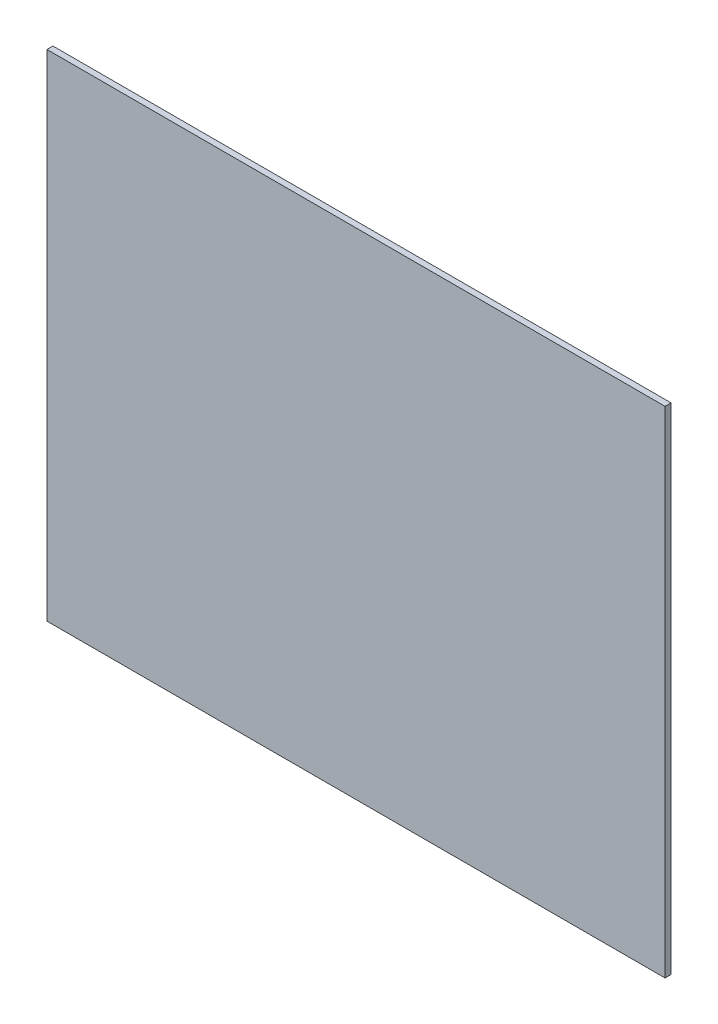
ISO-10303-21;
HEADER;
FILE_DESCRIPTION(('STEP AP214'),'2;1');
FILE_NAME('part.step','',(''),(''),'','','');
FILE_SCHEMA(('AUTOMOTIVE_DESIGN { 1 0 10303 214 1 1 1 1 }'));
ENDSEC;
DATA;
#1=APPLICATION_CONTEXT('core data for automotive mechanical design processes');
#2=APPLICATION_PROTOCOL_DEFINITION('international standard','automotive_design',2000,#1);
#3=PRODUCT_CONTEXT('',#1,'mechanical');
#4=PRODUCT('Part','Part','',(#3));
#5=PRODUCT_RELATED_PRODUCT_CATEGORY('part','',(#4));
#6=PRODUCT_DEFINITION_FORMATION('','',#4);
#7=PRODUCT_DEFINITION_CONTEXT('part definition',#1,'design');
#8=PRODUCT_DEFINITION('design','',#6,#7);
#9=PRODUCT_DEFINITION_SHAPE('','',#8);
#10=(LENGTH_UNIT() NAMED_UNIT(*) SI_UNIT(.MILLI.,.METRE.));
#11=(NAMED_UNIT(*) PLANE_ANGLE_UNIT() SI_UNIT($,.RADIAN.));
#12=(NAMED_UNIT(*) SI_UNIT($,.STERADIAN.) SOLID_ANGLE_UNIT());
#13=UNCERTAINTY_MEASURE_WITH_UNIT(LENGTH_MEASURE(1.E-05),#10,'distance_accuracy_value','');
#14=(GEOMETRIC_REPRESENTATION_CONTEXT(3) GLOBAL_UNCERTAINTY_ASSIGNED_CONTEXT((#13)) GLOBAL_UNIT_ASSIGNED_CONTEXT((#10,
#11,#12)) REPRESENTATION_CONTEXT('',''));
#15=CARTESIAN_POINT('',(0.,0.,0.));
#16=DIRECTION('',(0.,0.,1.));
#17=DIRECTION('',(1.,0.,0.));
#18=AXIS2_PLACEMENT_3D('',#15,#16,#17);
#19=CARTESIAN_POINT('',(0.,0.,4.));
#20=DIRECTION('',(1.,0.,0.));
#21=DIRECTION('',(0.,0.,-1.));
#22=AXIS2_PLACEMENT_3D('',#19,#20,#21);
#23=PLANE('',#22);
#24=DIRECTION('',(0.,-1.,0.));
#25=VECTOR('',#24,1.);
#26=CARTESIAN_POINT('',(0.,0.,0.));
#27=LINE('',#26,#25);
#28=CARTESIAN_POINT('',(0.,330.,0.));
#29=VERTEX_POINT('',#28);
#30=CARTESIAN_POINT('',(0.,0.,0.));
#31=VERTEX_POINT('',#30);
#32=EDGE_CURVE('E95',#29,#31,#27,.T.);
#33=ORIENTED_EDGE('',*,*,#32,.T.);
#34=DIRECTION('',(0.,0.,-1.));
#35=VECTOR('',#34,1.);
#36=CARTESIAN_POINT('',(0.,0.,4.));
#37=LINE('',#36,#35);
#38=CARTESIAN_POINT('',(0.,0.,4.));
#39=VERTEX_POINT('',#38);
#40=EDGE_CURVE('E11',#39,#31,#37,.T.);
#41=ORIENTED_EDGE('',*,*,#40,.F.);
#42=DIRECTION('',(0.,-1.,0.));
#43=VECTOR('',#42,1.);
#44=CARTESIAN_POINT('',(0.,0.,4.));
#45=LINE('',#44,#43);
#46=CARTESIAN_POINT('',(0.,330.,4.));
#47=VERTEX_POINT('',#46);
#48=EDGE_CURVE('E83',#47,#39,#45,.T.);
#49=ORIENTED_EDGE('',*,*,#48,.F.);
#50=DIRECTION('',(0.,0.,-1.));
#51=VECTOR('',#50,1.);
#52=CARTESIAN_POINT('',(0.,330.,4.));
#53=LINE('',#52,#51);
#54=EDGE_CURVE('E91',#47,#29,#53,.T.);
#55=ORIENTED_EDGE('',*,*,#54,.T.);
#56=EDGE_LOOP('',(#33,#41,#49,#55));
#57=FACE_BOUND('',#56,.T.);
#58=ADVANCED_FACE('F32',(#57),#23,.F.);
#59=CARTESIAN_POINT('',(0.,0.,4.));
#60=DIRECTION('',(0.,1.,0.));
#61=DIRECTION('',(0.,0.,1.));
#62=AXIS2_PLACEMENT_3D('',#59,#60,#61);
#63=PLANE('',#62);
#64=DIRECTION('',(1.,0.,0.));
#65=VECTOR('',#64,1.);
#66=CARTESIAN_POINT('',(0.,0.,0.));
#67=LINE('',#66,#65);
#68=CARTESIAN_POINT('',(412.,0.,0.));
#69=VERTEX_POINT('',#68);
#70=EDGE_CURVE('E87',#31,#69,#67,.T.);
#71=ORIENTED_EDGE('',*,*,#70,.T.);
#72=DIRECTION('',(0.,0.,-1.));
#73=VECTOR('',#72,1.);
#74=CARTESIAN_POINT('',(412.,0.,4.));
#75=LINE('',#74,#73);
#76=CARTESIAN_POINT('',(412.,0.,4.));
#77=VERTEX_POINT('',#76);
#78=EDGE_CURVE('E40',#77,#69,#75,.T.);
#79=ORIENTED_EDGE('',*,*,#78,.F.);
#80=DIRECTION('',(1.,0.,0.));
#81=VECTOR('',#80,1.);
#82=CARTESIAN_POINT('',(0.,0.,4.));
#83=LINE('',#82,#81);
#84=EDGE_CURVE('E78',#39,#77,#83,.T.);
#85=ORIENTED_EDGE('',*,*,#84,.F.);
#86=ORIENTED_EDGE('',*,*,#40,.T.);
#87=EDGE_LOOP('',(#71,#79,#85,#86));
#88=FACE_BOUND('',#87,.T.);
#89=ADVANCED_FACE('F86',(#88),#63,.F.);
#90=CARTESIAN_POINT('',(412.,0.,4.));
#91=DIRECTION('',(-1.,0.,0.));
#92=DIRECTION('',(0.,0.,1.));
#93=AXIS2_PLACEMENT_3D('',#90,#91,#92);
#94=PLANE('',#93);
#95=DIRECTION('',(0.,1.,0.));
#96=VECTOR('',#95,1.);
#97=CARTESIAN_POINT('',(412.,0.,0.));
#98=LINE('',#97,#96);
#99=CARTESIAN_POINT('',(412.,330.,0.));
#100=VERTEX_POINT('',#99);
#101=EDGE_CURVE('E65',#69,#100,#98,.T.);
#102=ORIENTED_EDGE('',*,*,#101,.T.);
#103=DIRECTION('',(0.,0.,-1.));
#104=VECTOR('',#103,1.);
#105=CARTESIAN_POINT('',(412.,330.,4.));
#106=LINE('',#105,#104);
#107=CARTESIAN_POINT('',(412.,330.,4.));
#108=VERTEX_POINT('',#107);
#109=EDGE_CURVE('E88',#108,#100,#106,.T.);
#110=ORIENTED_EDGE('',*,*,#109,.F.);
#111=DIRECTION('',(0.,1.,0.));
#112=VECTOR('',#111,1.);
#113=CARTESIAN_POINT('',(412.,0.,4.));
#114=LINE('',#113,#112);
#115=EDGE_CURVE('E81',#77,#108,#114,.T.);
#116=ORIENTED_EDGE('',*,*,#115,.F.);
#117=ORIENTED_EDGE('',*,*,#78,.T.);
#118=EDGE_LOOP('',(#102,#110,#116,#117));
#119=FACE_BOUND('',#118,.T.);
#120=ADVANCED_FACE('F89',(#119),#94,.F.);
#121=CARTESIAN_POINT('',(0.,330.,4.));
#122=DIRECTION('',(0.,-1.,0.));
#123=DIRECTION('',(0.,0.,-1.));
#124=AXIS2_PLACEMENT_3D('',#121,#122,#123);
#125=PLANE('',#124);
#126=DIRECTION('',(-1.,0.,0.));
#127=VECTOR('',#126,1.);
#128=CARTESIAN_POINT('',(0.,330.,0.));
#129=LINE('',#128,#127);
#130=EDGE_CURVE('E71',#100,#29,#129,.T.);
#131=ORIENTED_EDGE('',*,*,#130,.T.);
#132=ORIENTED_EDGE('',*,*,#54,.F.);
#133=DIRECTION('',(-1.,0.,0.));
#134=VECTOR('',#133,1.);
#135=CARTESIAN_POINT('',(0.,330.,4.));
#136=LINE('',#135,#134);
#137=EDGE_CURVE('E48',#108,#47,#136,.T.);
#138=ORIENTED_EDGE('',*,*,#137,.F.);
#139=ORIENTED_EDGE('',*,*,#109,.T.);
#140=EDGE_LOOP('',(#131,#132,#138,#139));
#141=FACE_BOUND('',#140,.T.);
#142=ADVANCED_FACE('F102',(#141),#125,.F.);
#143=CARTESIAN_POINT('',(0.,0.,4.));
#144=DIRECTION('',(0.,0.,-1.));
#145=DIRECTION('',(-1.,0.,0.));
#146=AXIS2_PLACEMENT_3D('',#143,#144,#145);
#147=PLANE('',#146);
#148=ORIENTED_EDGE('',*,*,#48,.T.);
#149=ORIENTED_EDGE('',*,*,#84,.T.);
#150=ORIENTED_EDGE('',*,*,#115,.T.);
#151=ORIENTED_EDGE('',*,*,#137,.T.);
#152=EDGE_LOOP('',(#148,#149,#150,#151));
#153=FACE_BOUND('',#152,.T.);
#154=ADVANCED_FACE('F79',(#153),#147,.F.);
#155=CARTESIAN_POINT('',(0.,0.,0.));
#156=DIRECTION('',(0.,0.,-1.));
#157=DIRECTION('',(-1.,0.,0.));
#158=AXIS2_PLACEMENT_3D('',#155,#156,#157);
#159=PLANE('',#158);
#160=ORIENTED_EDGE('',*,*,#32,.F.);
#161=ORIENTED_EDGE('',*,*,#130,.F.);
#162=ORIENTED_EDGE('',*,*,#101,.F.);
#163=ORIENTED_EDGE('',*,*,#70,.F.);
#164=EDGE_LOOP('',(#160,#161,#162,#163));
#165=FACE_BOUND('',#164,.T.);
#166=ADVANCED_FACE('F105',(#165),#159,.T.);
#167=CLOSED_SHELL('',(#58,#89,#120,#142,#154,#166));
#168=MANIFOLD_SOLID_BREP('B2',#167);
#169=ADVANCED_BREP_SHAPE_REPRESENTATION('',(#18,#168),#14);
#170=SHAPE_DEFINITION_REPRESENTATION(#9,#169);
ENDSEC;
END-ISO-10303-21;
